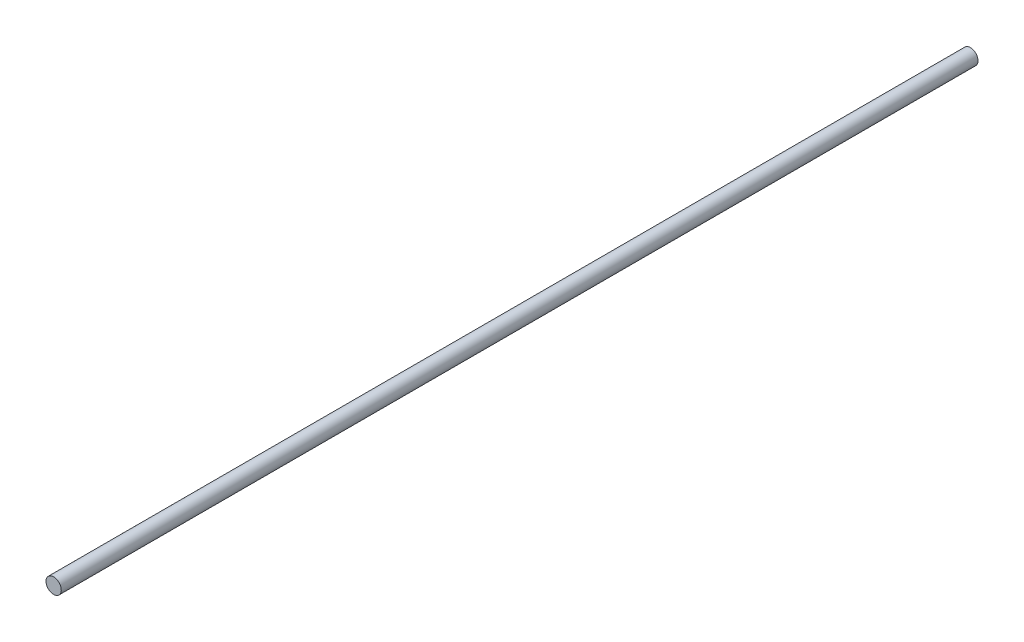
ISO-10303-21;
HEADER;
FILE_DESCRIPTION(('STEP AP214'),'2;1');
FILE_NAME('part.step','',(''),(''),'','','');
FILE_SCHEMA(('AUTOMOTIVE_DESIGN { 1 0 10303 214 1 1 1 1 }'));
ENDSEC;
DATA;
#1=APPLICATION_CONTEXT('core data for automotive mechanical design processes');
#2=APPLICATION_PROTOCOL_DEFINITION('international standard','automotive_design',2000,#1);
#3=PRODUCT_CONTEXT('',#1,'mechanical');
#4=PRODUCT('Part','Part','',(#3));
#5=PRODUCT_RELATED_PRODUCT_CATEGORY('part','',(#4));
#6=PRODUCT_DEFINITION_FORMATION('','',#4);
#7=PRODUCT_DEFINITION_CONTEXT('part definition',#1,'design');
#8=PRODUCT_DEFINITION('design','',#6,#7);
#9=PRODUCT_DEFINITION_SHAPE('','',#8);
#10=(LENGTH_UNIT() NAMED_UNIT(*) SI_UNIT(.MILLI.,.METRE.));
#11=(NAMED_UNIT(*) PLANE_ANGLE_UNIT() SI_UNIT($,.RADIAN.));
#12=(NAMED_UNIT(*) SI_UNIT($,.STERADIAN.) SOLID_ANGLE_UNIT());
#13=UNCERTAINTY_MEASURE_WITH_UNIT(LENGTH_MEASURE(1.E-05),#10,'distance_accuracy_value','');
#14=(GEOMETRIC_REPRESENTATION_CONTEXT(3) GLOBAL_UNCERTAINTY_ASSIGNED_CONTEXT((#13)) GLOBAL_UNIT_ASSIGNED_CONTEXT((#10,
#11,#12)) REPRESENTATION_CONTEXT('',''));
#15=CARTESIAN_POINT('',(0.,0.,0.));
#16=DIRECTION('',(0.,0.,1.));
#17=DIRECTION('',(1.,0.,0.));
#18=AXIS2_PLACEMENT_3D('',#15,#16,#17);
#19=CARTESIAN_POINT('',(0.,0.,1143.));
#20=DIRECTION('',(0.,0.,-1.));
#21=DIRECTION('',(-1.,0.,0.));
#22=AXIS2_PLACEMENT_3D('',#19,#20,#21);
#23=CYLINDRICAL_SURFACE('',#22,9.525);
#24=CARTESIAN_POINT('',(0.,0.,1143.));
#25=DIRECTION('',(0.,0.,1.));
#26=DIRECTION('',(1.,0.,0.));
#27=AXIS2_PLACEMENT_3D('',#24,#25,#26);
#28=CIRCLE('',#27,9.525);
#29=CARTESIAN_POINT('',(9.525,0.,1143.));
#30=VERTEX_POINT('',#29);
#31=EDGE_CURVE('E10',#30,#30,#28,.T.);
#32=ORIENTED_EDGE('',*,*,#31,.F.);
#33=EDGE_LOOP('',(#32));
#34=FACE_BOUND('',#33,.T.);
#35=CARTESIAN_POINT('',(0.,0.,0.));
#36=DIRECTION('',(0.,0.,1.));
#37=DIRECTION('',(1.,0.,0.));
#38=AXIS2_PLACEMENT_3D('',#35,#36,#37);
#39=CIRCLE('',#38,9.525);
#40=CARTESIAN_POINT('',(9.525,0.,0.));
#41=VERTEX_POINT('',#40);
#42=EDGE_CURVE('E33',#41,#41,#39,.T.);
#43=ORIENTED_EDGE('',*,*,#42,.T.);
#44=EDGE_LOOP('',(#43));
#45=FACE_BOUND('',#44,.T.);
#46=ADVANCED_FACE('F30',(#34,#45),#23,.T.);
#47=CARTESIAN_POINT('',(0.,0.,1143.));
#48=DIRECTION('',(0.,0.,1.));
#49=DIRECTION('',(1.,0.,0.));
#50=AXIS2_PLACEMENT_3D('',#47,#48,#49);
#51=PLANE('',#50);
#52=ORIENTED_EDGE('',*,*,#31,.T.);
#53=EDGE_LOOP('',(#52));
#54=FACE_BOUND('',#53,.T.);
#55=ADVANCED_FACE('F45',(#54),#51,.T.);
#56=CARTESIAN_POINT('',(0.,0.,0.));
#57=DIRECTION('',(0.,0.,1.));
#58=DIRECTION('',(1.,0.,0.));
#59=AXIS2_PLACEMENT_3D('',#56,#57,#58);
#60=PLANE('',#59);
#61=ORIENTED_EDGE('',*,*,#42,.F.);
#62=EDGE_LOOP('',(#61));
#63=FACE_BOUND('',#62,.T.);
#64=ADVANCED_FACE('F43',(#63),#60,.F.);
#65=CLOSED_SHELL('',(#46,#55,#64));
#66=MANIFOLD_SOLID_BREP('B2',#65);
#67=ADVANCED_BREP_SHAPE_REPRESENTATION('',(#18,#66),#14);
#68=SHAPE_DEFINITION_REPRESENTATION(#9,#67);
ENDSEC;
END-ISO-10303-21;
